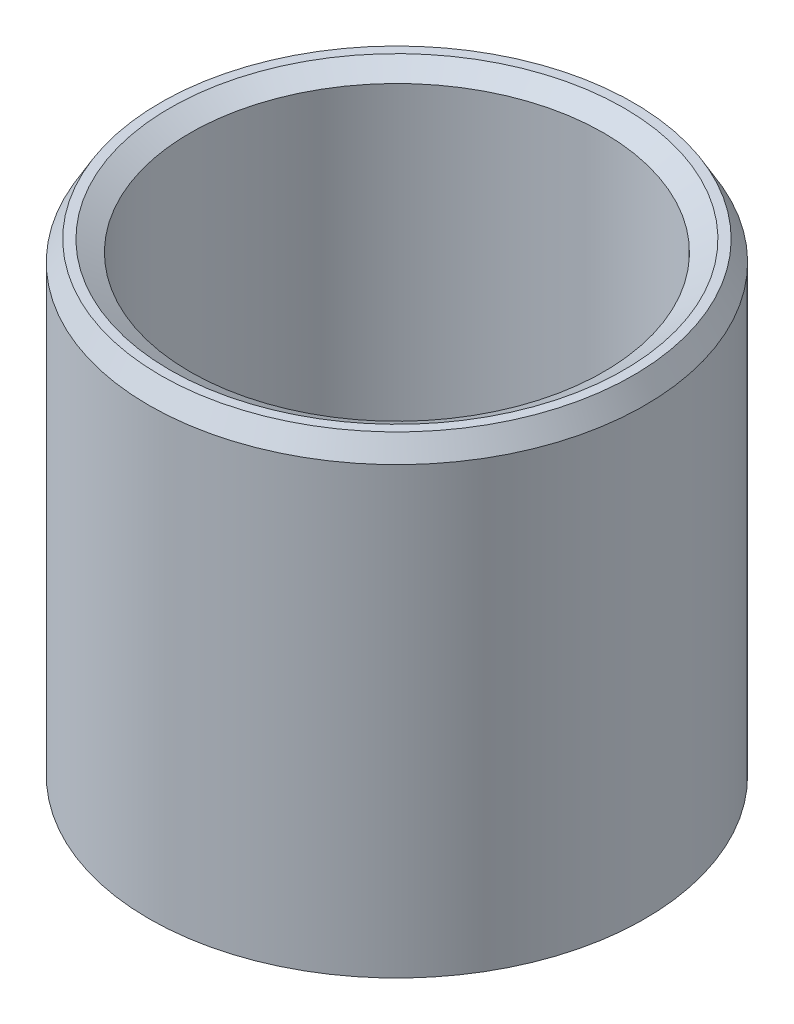
ISO-10303-21;
HEADER;
FILE_DESCRIPTION(('STEP AP214'),'2;1');
FILE_NAME('part.step','',(''),(''),'','','');
FILE_SCHEMA(('AUTOMOTIVE_DESIGN { 1 0 10303 214 1 1 1 1 }'));
ENDSEC;
DATA;
#1=APPLICATION_CONTEXT('core data for automotive mechanical design processes');
#2=APPLICATION_PROTOCOL_DEFINITION('international standard','automotive_design',2000,#1);
#3=PRODUCT_CONTEXT('',#1,'mechanical');
#4=PRODUCT('Part','Part','',(#3));
#5=PRODUCT_RELATED_PRODUCT_CATEGORY('part','',(#4));
#6=PRODUCT_DEFINITION_FORMATION('','',#4);
#7=PRODUCT_DEFINITION_CONTEXT('part definition',#1,'design');
#8=PRODUCT_DEFINITION('design','',#6,#7);
#9=PRODUCT_DEFINITION_SHAPE('','',#8);
#10=(LENGTH_UNIT() NAMED_UNIT(*) SI_UNIT(.MILLI.,.METRE.));
#11=(NAMED_UNIT(*) PLANE_ANGLE_UNIT() SI_UNIT($,.RADIAN.));
#12=(NAMED_UNIT(*) SI_UNIT($,.STERADIAN.) SOLID_ANGLE_UNIT());
#13=UNCERTAINTY_MEASURE_WITH_UNIT(LENGTH_MEASURE(1.E-05),#10,'distance_accuracy_value','');
#14=(GEOMETRIC_REPRESENTATION_CONTEXT(3) GLOBAL_UNCERTAINTY_ASSIGNED_CONTEXT((#13)) GLOBAL_UNIT_ASSIGNED_CONTEXT((#10,
#11,#12)) REPRESENTATION_CONTEXT('',''));
#15=CARTESIAN_POINT('',(0.,0.,0.));
#16=DIRECTION('',(0.,0.,1.));
#17=DIRECTION('',(1.,0.,0.));
#18=AXIS2_PLACEMENT_3D('',#15,#16,#17);
#19=CARTESIAN_POINT('',(0.,81.6453606359702,0.));
#20=DIRECTION('',(0.,-1.,0.));
#21=DIRECTION('',(0.,0.,-1.));
#22=AXIS2_PLACEMENT_3D('',#19,#20,#21);
#23=CYLINDRICAL_SURFACE('',#22,42.5);
#24=CARTESIAN_POINT('',(0.,1.99146446827712,0.));
#25=DIRECTION('',(0.,1.,0.));
#26=DIRECTION('',(0.,0.,1.));
#27=AXIS2_PLACEMENT_3D('',#24,#25,#26);
#28=CIRCLE('',#27,42.5);
#29=CARTESIAN_POINT('',(0.,1.99146446827712,42.5));
#30=VERTEX_POINT('',#29);
#31=EDGE_CURVE('E10',#30,#30,#28,.T.);
#32=ORIENTED_EDGE('',*,*,#31,.T.);
#33=EDGE_LOOP('',(#32));
#34=FACE_BOUND('',#33,.T.);
#35=CARTESIAN_POINT('',(0.,78.1960429954461,0.));
#36=DIRECTION('',(0.,1.,0.));
#37=DIRECTION('',(0.,0.,1.));
#38=AXIS2_PLACEMENT_3D('',#35,#36,#37);
#39=CIRCLE('',#38,42.5);
#40=CARTESIAN_POINT('',(0.,78.1960429954461,42.5));
#41=VERTEX_POINT('',#40);
#42=EDGE_CURVE('E50',#41,#41,#39,.F.);
#43=ORIENTED_EDGE('',*,*,#42,.T.);
#44=EDGE_LOOP('',(#43));
#45=FACE_BOUND('',#44,.T.);
#46=ADVANCED_FACE('F39',(#34,#45),#23,.T.);
#47=CARTESIAN_POINT('',(0.,81.6453606359702,0.));
#48=DIRECTION('',(0.,1.,0.));
#49=DIRECTION('',(0.,0.,1.));
#50=AXIS2_PLACEMENT_3D('',#47,#48,#49);
#51=PLANE('',#50);
#52=CARTESIAN_POINT('',(0.,81.6453606359702,0.));
#53=DIRECTION('',(0.,1.,0.));
#54=DIRECTION('',(0.,0.,1.));
#55=AXIS2_PLACEMENT_3D('',#52,#53,#54);
#56=CIRCLE('',#55,38.9059047697363);
#57=CARTESIAN_POINT('',(0.,81.6453606359702,38.9059047697363));
#58=VERTEX_POINT('',#57);
#59=EDGE_CURVE('E58',#58,#58,#56,.F.);
#60=ORIENTED_EDGE('',*,*,#59,.T.);
#61=EDGE_LOOP('',(#60));
#62=FACE_BOUND('',#61,.T.);
#63=CARTESIAN_POINT('',(0.,81.6453606359702,0.));
#64=DIRECTION('',(0.,1.,0.));
#65=DIRECTION('',(0.,0.,1.));
#66=AXIS2_PLACEMENT_3D('',#63,#64,#65);
#67=CIRCLE('',#66,40.5085355317229);
#68=CARTESIAN_POINT('',(0.,81.6453606359702,40.5085355317229));
#69=VERTEX_POINT('',#68);
#70=EDGE_CURVE('E61',#69,#69,#67,.T.);
#71=ORIENTED_EDGE('',*,*,#70,.T.);
#72=EDGE_LOOP('',(#71));
#73=FACE_BOUND('',#72,.T.);
#74=ADVANCED_FACE('F88',(#62,#73),#51,.T.);
#75=CARTESIAN_POINT('',(0.,0.,0.));
#76=DIRECTION('',(0.,1.,0.));
#77=DIRECTION('',(0.,0.,1.));
#78=AXIS2_PLACEMENT_3D('',#75,#76,#77);
#79=PLANE('',#78);
#80=CARTESIAN_POINT('',(0.,0.,0.));
#81=DIRECTION('',(0.,1.,0.));
#82=DIRECTION('',(0.,0.,1.));
#83=AXIS2_PLACEMENT_3D('',#80,#81,#82);
#84=CIRCLE('',#83,37.4480515974892);
#85=CARTESIAN_POINT('',(0.,0.,37.4480515974892));
#86=VERTEX_POINT('',#85);
#87=EDGE_CURVE('E51',#86,#86,#84,.T.);
#88=ORIENTED_EDGE('',*,*,#87,.T.);
#89=EDGE_LOOP('',(#88));
#90=FACE_BOUND('',#89,.T.);
#91=CARTESIAN_POINT('',(0.,0.,0.));
#92=DIRECTION('',(0.,1.,0.));
#93=DIRECTION('',(0.,0.,1.));
#94=AXIS2_PLACEMENT_3D('',#91,#92,#93);
#95=CIRCLE('',#94,39.0506823594759);
#96=CARTESIAN_POINT('',(0.,0.,39.0506823594759));
#97=VERTEX_POINT('',#96);
#98=EDGE_CURVE('E54',#97,#97,#95,.F.);
#99=ORIENTED_EDGE('',*,*,#98,.T.);
#100=EDGE_LOOP('',(#99));
#101=FACE_BOUND('',#100,.T.);
#102=ADVANCED_FACE('F83',(#90,#101),#79,.F.);
#103=CARTESIAN_POINT('',(0.,81.6453606359702,0.));
#104=DIRECTION('',(0.,-1.,0.));
#105=DIRECTION('',(0.,0.,-1.));
#106=AXIS2_PLACEMENT_3D('',#103,#104,#105);
#107=CYLINDRICAL_SURFACE('',#106,35.4565871292121);
#108=CARTESIAN_POINT('',(0.,79.6538961676931,0.));
#109=DIRECTION('',(0.,1.,0.));
#110=DIRECTION('',(0.,0.,1.));
#111=AXIS2_PLACEMENT_3D('',#108,#109,#110);
#112=CIRCLE('',#111,35.4565871292121);
#113=CARTESIAN_POINT('',(0.,79.6538961676931,35.4565871292121));
#114=VERTEX_POINT('',#113);
#115=EDGE_CURVE('E67',#114,#114,#112,.T.);
#116=ORIENTED_EDGE('',*,*,#115,.T.);
#117=EDGE_LOOP('',(#116));
#118=FACE_BOUND('',#117,.T.);
#119=CARTESIAN_POINT('',(0.,3.44931764052414,0.));
#120=DIRECTION('',(0.,1.,0.));
#121=DIRECTION('',(0.,0.,1.));
#122=AXIS2_PLACEMENT_3D('',#119,#120,#121);
#123=CIRCLE('',#122,35.4565871292121);
#124=CARTESIAN_POINT('',(0.,3.44931764052414,35.4565871292121));
#125=VERTEX_POINT('',#124);
#126=EDGE_CURVE('E69',#125,#125,#123,.F.);
#127=ORIENTED_EDGE('',*,*,#126,.T.);
#128=EDGE_LOOP('',(#127));
#129=FACE_BOUND('',#128,.T.);
#130=ADVANCED_FACE('F71',(#118,#129),#107,.F.);
#131=CARTESIAN_POINT('',(0.,79.6538961676931,0.));
#132=DIRECTION('',(0.,1.,0.));
#133=DIRECTION('',(0.,0.,1.));
#134=AXIS2_PLACEMENT_3D('',#131,#132,#133);
#135=CONICAL_SURFACE('',#134,35.4565871292121,1.0471975511966);
#136=ORIENTED_EDGE('',*,*,#59,.F.);
#137=EDGE_LOOP('',(#136));
#138=FACE_BOUND('',#137,.T.);
#139=ORIENTED_EDGE('',*,*,#115,.F.);
#140=EDGE_LOOP('',(#139));
#141=FACE_BOUND('',#140,.T.);
#142=ADVANCED_FACE('F77',(#138,#141),#135,.F.);
#143=CARTESIAN_POINT('',(0.,0.,0.));
#144=DIRECTION('',(0.,-1.,0.));
#145=DIRECTION('',(0.,0.,-1.));
#146=AXIS2_PLACEMENT_3D('',#143,#144,#145);
#147=CONICAL_SURFACE('',#146,37.4480515974892,0.523598775598294);
#148=ORIENTED_EDGE('',*,*,#126,.F.);
#149=EDGE_LOOP('',(#148));
#150=FACE_BOUND('',#149,.T.);
#151=ORIENTED_EDGE('',*,*,#87,.F.);
#152=EDGE_LOOP('',(#151));
#153=FACE_BOUND('',#152,.T.);
#154=ADVANCED_FACE('F73',(#150,#153),#147,.F.);
#155=CARTESIAN_POINT('',(0.,1.99146446827712,0.));
#156=DIRECTION('',(0.,1.,0.));
#157=DIRECTION('',(0.,0.,1.));
#158=AXIS2_PLACEMENT_3D('',#155,#156,#157);
#159=CONICAL_SURFACE('',#158,42.5,1.0471975511966);
#160=ORIENTED_EDGE('',*,*,#98,.F.);
#161=EDGE_LOOP('',(#160));
#162=FACE_BOUND('',#161,.T.);
#163=ORIENTED_EDGE('',*,*,#31,.F.);
#164=EDGE_LOOP('',(#163));
#165=FACE_BOUND('',#164,.T.);
#166=ADVANCED_FACE('F76',(#162,#165),#159,.T.);
#167=CARTESIAN_POINT('',(0.,81.6453606359702,0.));
#168=DIRECTION('',(0.,-1.,0.));
#169=DIRECTION('',(0.,0.,-1.));
#170=AXIS2_PLACEMENT_3D('',#167,#168,#169);
#171=CONICAL_SURFACE('',#170,40.5085355317229,0.523598775598296);
#172=ORIENTED_EDGE('',*,*,#42,.F.);
#173=EDGE_LOOP('',(#172));
#174=FACE_BOUND('',#173,.T.);
#175=ORIENTED_EDGE('',*,*,#70,.F.);
#176=EDGE_LOOP('',(#175));
#177=FACE_BOUND('',#176,.T.);
#178=ADVANCED_FACE('F45',(#174,#177),#171,.T.);
#179=CLOSED_SHELL('',(#46,#74,#102,#130,#142,#154,#166,#178));
#180=MANIFOLD_SOLID_BREP('B2',#179);
#181=ADVANCED_BREP_SHAPE_REPRESENTATION('',(#18,#180),#14);
#182=SHAPE_DEFINITION_REPRESENTATION(#9,#181);
ENDSEC;
END-ISO-10303-21;
